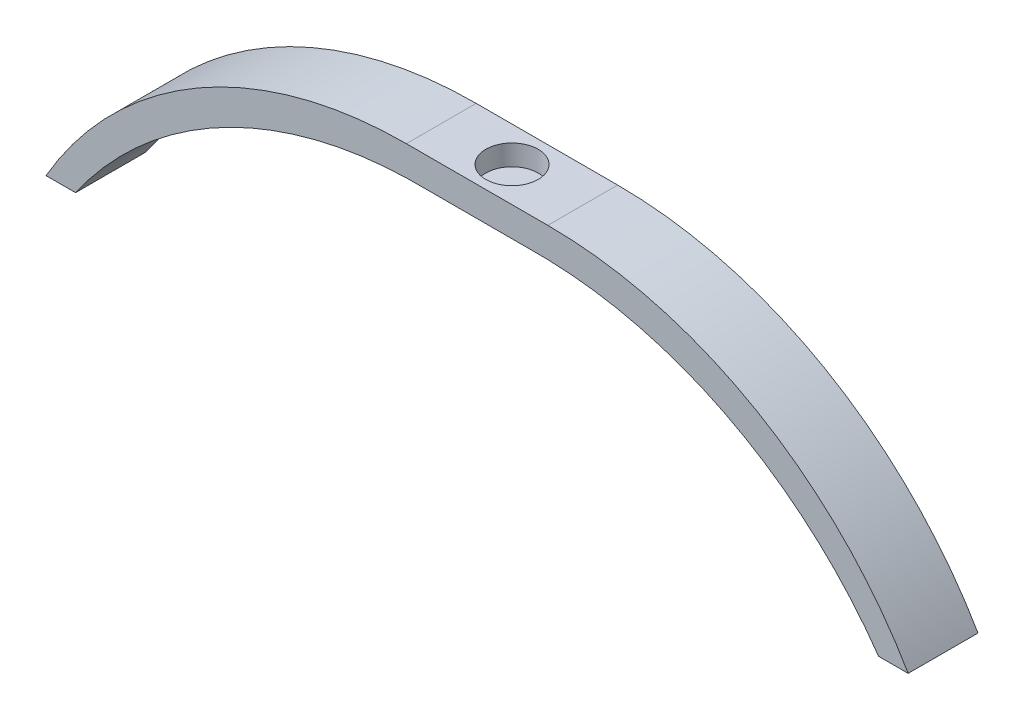
ISO-10303-21;
HEADER;
FILE_DESCRIPTION(('STEP AP214'),'2;1');
FILE_NAME('part.step','',(''),(''),'','','');
FILE_SCHEMA(('AUTOMOTIVE_DESIGN { 1 0 10303 214 1 1 1 1 }'));
ENDSEC;
DATA;
#1=APPLICATION_CONTEXT('core data for automotive mechanical design processes');
#2=APPLICATION_PROTOCOL_DEFINITION('international standard','automotive_design',2000,#1);
#3=PRODUCT_CONTEXT('',#1,'mechanical');
#4=PRODUCT('Part','Part','',(#3));
#5=PRODUCT_RELATED_PRODUCT_CATEGORY('part','',(#4));
#6=PRODUCT_DEFINITION_FORMATION('','',#4);
#7=PRODUCT_DEFINITION_CONTEXT('part definition',#1,'design');
#8=PRODUCT_DEFINITION('design','',#6,#7);
#9=PRODUCT_DEFINITION_SHAPE('','',#8);
#10=(LENGTH_UNIT() NAMED_UNIT(*) SI_UNIT(.MILLI.,.METRE.));
#11=(NAMED_UNIT(*) PLANE_ANGLE_UNIT() SI_UNIT($,.RADIAN.));
#12=(NAMED_UNIT(*) SI_UNIT($,.STERADIAN.) SOLID_ANGLE_UNIT());
#13=UNCERTAINTY_MEASURE_WITH_UNIT(LENGTH_MEASURE(1.E-05),#10,'distance_accuracy_value','');
#14=(GEOMETRIC_REPRESENTATION_CONTEXT(3) GLOBAL_UNCERTAINTY_ASSIGNED_CONTEXT((#13)) GLOBAL_UNIT_ASSIGNED_CONTEXT((#10,
#11,#12)) REPRESENTATION_CONTEXT('',''));
#15=CARTESIAN_POINT('',(0.,0.,0.));
#16=DIRECTION('',(0.,0.,1.));
#17=DIRECTION('',(1.,0.,0.));
#18=AXIS2_PLACEMENT_3D('',#15,#16,#17);
#19=CARTESIAN_POINT('',(-7.62,4.3,-5.08));
#20=DIRECTION('',(0.,0.,1.));
#21=DIRECTION('',(1.,0.,0.));
#22=AXIS2_PLACEMENT_3D('',#19,#20,#21);
#23=PLANE('',#22);
#24=DIRECTION('',(-1.,0.,0.));
#25=VECTOR('',#24,1.);
#26=CARTESIAN_POINT('',(-7.62,0.,-5.08));
#27=LINE('',#26,#25);
#28=CARTESIAN_POINT('',(7.62,0.,-5.08));
#29=VERTEX_POINT('',#28);
#30=CARTESIAN_POINT('',(-7.62,0.,-5.08));
#31=VERTEX_POINT('',#30);
#32=EDGE_CURVE('E59',#29,#31,#27,.T.);
#33=ORIENTED_EDGE('',*,*,#32,.T.);
#34=DIRECTION('',(0.99997133683787,0.00757136068906019,0.));
#35=VECTOR('',#34,1.);
#36=CARTESIAN_POINT('',(-0.000436820330450907,0.0576921147647997,-5.08));
#37=LINE('',#36,#35);
#38=CARTESIAN_POINT('',(-10.29,-0.0202161124975009,-5.08));
#39=VERTEX_POINT('',#38);
#40=EDGE_CURVE('E151',#39,#31,#37,.T.);
#41=ORIENTED_EDGE('',*,*,#40,.F.);
#42=CARTESIAN_POINT('',(-8.72520890316216,-60.57,-5.08));
#43=DIRECTION('',(0.,0.,1.));
#44=DIRECTION('',(1.,0.,0.));
#45=AXIS2_PLACEMENT_3D('',#42,#43,#44);
#46=CIRCLE('',#45,60.57);
#47=CARTESIAN_POINT('',(-58.4191521960827,-25.94,-5.08));
#48=VERTEX_POINT('',#47);
#49=EDGE_CURVE('E122',#48,#39,#46,.F.);
#50=ORIENTED_EDGE('',*,*,#49,.F.);
#51=DIRECTION('',(-1.,0.,0.));
#52=VECTOR('',#51,1.);
#53=CARTESIAN_POINT('',(0.,-25.94,-5.08));
#54=LINE('',#53,#52);
#55=CARTESIAN_POINT('',(-62.7191521960827,-25.94,-5.08));
#56=VERTEX_POINT('',#55);
#57=EDGE_CURVE('E220',#48,#56,#54,.T.);
#58=ORIENTED_EDGE('',*,*,#57,.T.);
#59=CARTESIAN_POINT('',(-10.29,-56.27,-5.08));
#60=DIRECTION('',(0.,0.,1.));
#61=DIRECTION('',(1.,0.,0.));
#62=AXIS2_PLACEMENT_3D('',#59,#60,#61);
#63=CIRCLE('',#62,60.57);
#64=CARTESIAN_POINT('',(-10.29,4.3,-5.08));
#65=VERTEX_POINT('',#64);
#66=EDGE_CURVE('E157',#65,#56,#63,.T.);
#67=ORIENTED_EDGE('',*,*,#66,.F.);
#68=DIRECTION('',(-1.,0.,0.));
#69=VECTOR('',#68,1.);
#70=CARTESIAN_POINT('',(-7.62,4.3,-5.08));
#71=LINE('',#70,#69);
#72=CARTESIAN_POINT('',(10.29,4.3,-5.08));
#73=VERTEX_POINT('',#72);
#74=EDGE_CURVE('E47',#73,#65,#71,.T.);
#75=ORIENTED_EDGE('',*,*,#74,.F.);
#76=CARTESIAN_POINT('',(10.29,-56.27,-5.08));
#77=DIRECTION('',(0.,0.,1.));
#78=DIRECTION('',(1.,0.,0.));
#79=AXIS2_PLACEMENT_3D('',#76,#77,#78);
#80=CIRCLE('',#79,60.57);
#81=CARTESIAN_POINT('',(62.7191521960827,-25.94,-5.08));
#82=VERTEX_POINT('',#81);
#83=EDGE_CURVE('E166',#73,#82,#80,.F.);
#84=ORIENTED_EDGE('',*,*,#83,.T.);
#85=DIRECTION('',(1.,0.,0.));
#86=VECTOR('',#85,1.);
#87=CARTESIAN_POINT('',(0.,-25.94,-5.08));
#88=LINE('',#87,#86);
#89=CARTESIAN_POINT('',(58.4191521960827,-25.94,-5.08));
#90=VERTEX_POINT('',#89);
#91=EDGE_CURVE('E163',#90,#82,#88,.T.);
#92=ORIENTED_EDGE('',*,*,#91,.F.);
#93=CARTESIAN_POINT('',(8.72520890316216,-60.57,-5.08));
#94=DIRECTION('',(0.,0.,1.));
#95=DIRECTION('',(1.,0.,0.));
#96=AXIS2_PLACEMENT_3D('',#93,#94,#95);
#97=CIRCLE('',#96,60.57);
#98=CARTESIAN_POINT('',(10.29,-0.0202161124975009,-5.08));
#99=VERTEX_POINT('',#98);
#100=EDGE_CURVE('E160',#90,#99,#97,.T.);
#101=ORIENTED_EDGE('',*,*,#100,.T.);
#102=DIRECTION('',(-0.99997133683787,0.00757136068906019,0.));
#103=VECTOR('',#102,1.);
#104=CARTESIAN_POINT('',(0.000436820330450907,0.0576921147647997,-5.08));
#105=LINE('',#104,#103);
#106=EDGE_CURVE('E158',#99,#29,#105,.T.);
#107=ORIENTED_EDGE('',*,*,#106,.T.);
#108=EDGE_LOOP('',(#33,#41,#50,#58,#67,#75,#84,#92,#101,#107));
#109=FACE_BOUND('',#108,.T.);
#110=ADVANCED_FACE('F39',(#109),#23,.F.);
#111=CARTESIAN_POINT('',(-7.62,4.3,5.08));
#112=DIRECTION('',(0.,0.,-1.));
#113=DIRECTION('',(-1.,0.,0.));
#114=AXIS2_PLACEMENT_3D('',#111,#112,#113);
#115=PLANE('',#114);
#116=DIRECTION('',(1.,0.,0.));
#117=VECTOR('',#116,1.);
#118=CARTESIAN_POINT('',(-7.62,0.,5.08));
#119=LINE('',#118,#117);
#120=CARTESIAN_POINT('',(-7.62,0.,5.08));
#121=VERTEX_POINT('',#120);
#122=CARTESIAN_POINT('',(7.62,0.,5.08));
#123=VERTEX_POINT('',#122);
#124=EDGE_CURVE('E42',#121,#123,#119,.T.);
#125=ORIENTED_EDGE('',*,*,#124,.T.);
#126=DIRECTION('',(0.99997133683787,-0.00757136068906019,0.));
#127=VECTOR('',#126,1.);
#128=CARTESIAN_POINT('',(0.000436820330450907,0.0576921147647997,5.08));
#129=LINE('',#128,#127);
#130=CARTESIAN_POINT('',(10.29,-0.0202161124975009,5.08));
#131=VERTEX_POINT('',#130);
#132=EDGE_CURVE('E173',#123,#131,#129,.T.);
#133=ORIENTED_EDGE('',*,*,#132,.T.);
#134=CARTESIAN_POINT('',(8.72520890316216,-60.57,5.08));
#135=DIRECTION('',(0.,0.,1.));
#136=DIRECTION('',(1.,0.,0.));
#137=AXIS2_PLACEMENT_3D('',#134,#135,#136);
#138=CIRCLE('',#137,60.57);
#139=CARTESIAN_POINT('',(58.4191521960827,-25.94,5.08));
#140=VERTEX_POINT('',#139);
#141=EDGE_CURVE('E176',#131,#140,#138,.F.);
#142=ORIENTED_EDGE('',*,*,#141,.T.);
#143=DIRECTION('',(-1.,0.,0.));
#144=VECTOR('',#143,1.);
#145=CARTESIAN_POINT('',(0.,-25.94,5.08));
#146=LINE('',#145,#144);
#147=CARTESIAN_POINT('',(62.7191521960827,-25.94,5.08));
#148=VERTEX_POINT('',#147);
#149=EDGE_CURVE('E167',#148,#140,#146,.T.);
#150=ORIENTED_EDGE('',*,*,#149,.F.);
#151=CARTESIAN_POINT('',(10.29,-56.27,5.08));
#152=DIRECTION('',(0.,0.,1.));
#153=DIRECTION('',(1.,0.,0.));
#154=AXIS2_PLACEMENT_3D('',#151,#152,#153);
#155=CIRCLE('',#154,60.57);
#156=CARTESIAN_POINT('',(10.29,4.3,5.08));
#157=VERTEX_POINT('',#156);
#158=EDGE_CURVE('E170',#148,#157,#155,.T.);
#159=ORIENTED_EDGE('',*,*,#158,.T.);
#160=DIRECTION('',(1.,0.,0.));
#161=VECTOR('',#160,1.);
#162=CARTESIAN_POINT('',(-7.62,4.3,5.08));
#163=LINE('',#162,#161);
#164=CARTESIAN_POINT('',(-10.29,4.3,5.08));
#165=VERTEX_POINT('',#164);
#166=EDGE_CURVE('E11',#165,#157,#163,.T.);
#167=ORIENTED_EDGE('',*,*,#166,.F.);
#168=CARTESIAN_POINT('',(-10.29,-56.27,5.08));
#169=DIRECTION('',(0.,0.,1.));
#170=DIRECTION('',(1.,0.,0.));
#171=AXIS2_PLACEMENT_3D('',#168,#169,#170);
#172=CIRCLE('',#171,60.57);
#173=CARTESIAN_POINT('',(-62.7191521960827,-25.94,5.08));
#174=VERTEX_POINT('',#173);
#175=EDGE_CURVE('E133',#174,#165,#172,.F.);
#176=ORIENTED_EDGE('',*,*,#175,.F.);
#177=DIRECTION('',(1.,0.,0.));
#178=VECTOR('',#177,1.);
#179=CARTESIAN_POINT('',(0.,-25.94,5.08));
#180=LINE('',#179,#178);
#181=CARTESIAN_POINT('',(-58.4191521960827,-25.94,5.08));
#182=VERTEX_POINT('',#181);
#183=EDGE_CURVE('E126',#174,#182,#180,.T.);
#184=ORIENTED_EDGE('',*,*,#183,.T.);
#185=CARTESIAN_POINT('',(-8.72520890316216,-60.57,5.08));
#186=DIRECTION('',(0.,0.,1.));
#187=DIRECTION('',(1.,0.,0.));
#188=AXIS2_PLACEMENT_3D('',#185,#186,#187);
#189=CIRCLE('',#188,60.57);
#190=CARTESIAN_POINT('',(-10.29,-0.0202161124975009,5.08));
#191=VERTEX_POINT('',#190);
#192=EDGE_CURVE('E120',#191,#182,#189,.T.);
#193=ORIENTED_EDGE('',*,*,#192,.F.);
#194=DIRECTION('',(-0.99997133683787,-0.00757136068906019,0.));
#195=VECTOR('',#194,1.);
#196=CARTESIAN_POINT('',(-0.000436820330450907,0.0576921147647997,5.08));
#197=LINE('',#196,#195);
#198=EDGE_CURVE('E129',#121,#191,#197,.T.);
#199=ORIENTED_EDGE('',*,*,#198,.F.);
#200=EDGE_LOOP('',(#125,#133,#142,#150,#159,#167,#176,#184,#193,#199));
#201=FACE_BOUND('',#200,.T.);
#202=ADVANCED_FACE('F135',(#201),#115,.F.);
#203=CARTESIAN_POINT('',(0.,4.3,0.));
#204=DIRECTION('',(0.,1.,0.));
#205=DIRECTION('',(0.,0.,1.));
#206=AXIS2_PLACEMENT_3D('',#203,#204,#205);
#207=PLANE('',#206);
#208=CARTESIAN_POINT('',(0.,4.3,0.));
#209=DIRECTION('',(0.,1.,0.));
#210=DIRECTION('',(0.,0.,1.));
#211=AXIS2_PLACEMENT_3D('',#208,#209,#210);
#212=CIRCLE('',#211,3.81);
#213=CARTESIAN_POINT('',(0.,4.3,3.81));
#214=VERTEX_POINT('',#213);
#215=EDGE_CURVE('E141',#214,#214,#212,.T.);
#216=ORIENTED_EDGE('',*,*,#215,.F.);
#217=EDGE_LOOP('',(#216));
#218=FACE_BOUND('',#217,.T.);
#219=ORIENTED_EDGE('',*,*,#166,.T.);
#220=DIRECTION('',(0.,0.,1.));
#221=VECTOR('',#220,1.);
#222=CARTESIAN_POINT('',(10.29,4.3,-67.9320021377766));
#223=LINE('',#222,#221);
#224=EDGE_CURVE('E183',#73,#157,#223,.T.);
#225=ORIENTED_EDGE('',*,*,#224,.F.);
#226=ORIENTED_EDGE('',*,*,#74,.T.);
#227=DIRECTION('',(0.,0.,1.));
#228=VECTOR('',#227,1.);
#229=CARTESIAN_POINT('',(-10.29,4.3,-67.9320021377766));
#230=LINE('',#229,#228);
#231=EDGE_CURVE('E125',#65,#165,#230,.T.);
#232=ORIENTED_EDGE('',*,*,#231,.T.);
#233=EDGE_LOOP('',(#219,#225,#226,#232));
#234=FACE_BOUND('',#233,.T.);
#235=ADVANCED_FACE('F211',(#218,#234),#207,.T.);
#236=CARTESIAN_POINT('',(0.,0.,0.));
#237=DIRECTION('',(0.,1.,0.));
#238=DIRECTION('',(0.,0.,1.));
#239=AXIS2_PLACEMENT_3D('',#236,#237,#238);
#240=PLANE('',#239);
#241=DIRECTION('',(0.,0.,-1.));
#242=VECTOR('',#241,1.);
#243=CARTESIAN_POINT('',(7.62,0.,-5.08));
#244=LINE('',#243,#242);
#245=EDGE_CURVE('E188',#123,#29,#244,.T.);
#246=ORIENTED_EDGE('',*,*,#245,.F.);
#247=ORIENTED_EDGE('',*,*,#124,.F.);
#248=DIRECTION('',(0.,0.,1.));
#249=VECTOR('',#248,1.);
#250=CARTESIAN_POINT('',(-7.62,0.,-5.08));
#251=LINE('',#250,#249);
#252=EDGE_CURVE('E131',#31,#121,#251,.T.);
#253=ORIENTED_EDGE('',*,*,#252,.F.);
#254=ORIENTED_EDGE('',*,*,#32,.F.);
#255=EDGE_LOOP('',(#246,#247,#253,#254));
#256=FACE_BOUND('',#255,.T.);
#257=ADVANCED_FACE('F230',(#256),#240,.F.);
#258=CARTESIAN_POINT('',(0.,-25.94,-67.9320021377766));
#259=DIRECTION('',(0.,1.,0.));
#260=DIRECTION('',(0.,0.,1.));
#261=AXIS2_PLACEMENT_3D('',#258,#259,#260);
#262=PLANE('',#261);
#263=DIRECTION('',(0.,0.,1.));
#264=VECTOR('',#263,1.);
#265=CARTESIAN_POINT('',(58.4191521960827,-25.94,-67.9320021377766));
#266=LINE('',#265,#264);
#267=EDGE_CURVE('E161',#90,#140,#266,.T.);
#268=ORIENTED_EDGE('',*,*,#267,.F.);
#269=ORIENTED_EDGE('',*,*,#91,.T.);
#270=DIRECTION('',(0.,0.,1.));
#271=VECTOR('',#270,1.);
#272=CARTESIAN_POINT('',(62.7191521960827,-25.94,-67.9320021377766));
#273=LINE('',#272,#271);
#274=EDGE_CURVE('E179',#82,#148,#273,.T.);
#275=ORIENTED_EDGE('',*,*,#274,.T.);
#276=ORIENTED_EDGE('',*,*,#149,.T.);
#277=EDGE_LOOP('',(#268,#269,#275,#276));
#278=FACE_BOUND('',#277,.T.);
#279=ADVANCED_FACE('F236',(#278),#262,.F.);
#280=CARTESIAN_POINT('',(8.72520890316216,-60.57,-67.9320021377766));
#281=DIRECTION('',(0.,0.,1.));
#282=DIRECTION('',(1.,0.,0.));
#283=AXIS2_PLACEMENT_3D('',#280,#281,#282);
#284=CYLINDRICAL_SURFACE('',#283,60.57);
#285=ORIENTED_EDGE('',*,*,#100,.F.);
#286=ORIENTED_EDGE('',*,*,#267,.T.);
#287=ORIENTED_EDGE('',*,*,#141,.F.);
#288=DIRECTION('',(0.,0.,1.));
#289=VECTOR('',#288,1.);
#290=CARTESIAN_POINT('',(10.29,-0.0202161124975009,-67.9320021377766));
#291=LINE('',#290,#289);
#292=EDGE_CURVE('E181',#99,#131,#291,.T.);
#293=ORIENTED_EDGE('',*,*,#292,.F.);
#294=EDGE_LOOP('',(#285,#286,#287,#293));
#295=FACE_BOUND('',#294,.T.);
#296=ADVANCED_FACE('F200',(#295),#284,.F.);
#297=CARTESIAN_POINT('',(0.000436820330450907,0.0576921147647997,-67.9320021377766));
#298=DIRECTION('',(-0.00757136068906019,-0.99997133683787,0.));
#299=DIRECTION('',(0.99997133683787,-0.00757136068906019,0.));
#300=AXIS2_PLACEMENT_3D('',#297,#298,#299);
#301=PLANE('',#300);
#302=ORIENTED_EDGE('',*,*,#106,.F.);
#303=ORIENTED_EDGE('',*,*,#292,.T.);
#304=ORIENTED_EDGE('',*,*,#132,.F.);
#305=ORIENTED_EDGE('',*,*,#245,.T.);
#306=EDGE_LOOP('',(#302,#303,#304,#305));
#307=FACE_BOUND('',#306,.T.);
#308=ADVANCED_FACE('F196',(#307),#301,.T.);
#309=CARTESIAN_POINT('',(10.29,-56.27,-67.9320021377766));
#310=DIRECTION('',(0.,0.,1.));
#311=DIRECTION('',(1.,0.,0.));
#312=AXIS2_PLACEMENT_3D('',#309,#310,#311);
#313=CYLINDRICAL_SURFACE('',#312,60.57);
#314=ORIENTED_EDGE('',*,*,#83,.F.);
#315=ORIENTED_EDGE('',*,*,#224,.T.);
#316=ORIENTED_EDGE('',*,*,#158,.F.);
#317=ORIENTED_EDGE('',*,*,#274,.F.);
#318=EDGE_LOOP('',(#314,#315,#316,#317));
#319=FACE_BOUND('',#318,.T.);
#320=ADVANCED_FACE('F208',(#319),#313,.T.);
#321=CARTESIAN_POINT('',(-0.000436820330450907,0.0576921147647997,-67.9320021377766));
#322=DIRECTION('',(-0.00757136068906019,0.99997133683787,0.));
#323=DIRECTION('',(-0.99997133683787,-0.00757136068906019,0.));
#324=AXIS2_PLACEMENT_3D('',#321,#322,#323);
#325=PLANE('',#324);
#326=DIRECTION('',(0.,0.,1.));
#327=VECTOR('',#326,1.);
#328=CARTESIAN_POINT('',(-10.29,-0.0202161124975009,-67.9320021377766));
#329=LINE('',#328,#327);
#330=EDGE_CURVE('E115',#39,#191,#329,.T.);
#331=ORIENTED_EDGE('',*,*,#330,.F.);
#332=ORIENTED_EDGE('',*,*,#40,.T.);
#333=ORIENTED_EDGE('',*,*,#252,.T.);
#334=ORIENTED_EDGE('',*,*,#198,.T.);
#335=EDGE_LOOP('',(#331,#332,#333,#334));
#336=FACE_BOUND('',#335,.T.);
#337=ADVANCED_FACE('F130',(#336),#325,.F.);
#338=CARTESIAN_POINT('',(-10.29,-56.27,-67.9320021377766));
#339=DIRECTION('',(0.,0.,1.));
#340=DIRECTION('',(1.,0.,0.));
#341=AXIS2_PLACEMENT_3D('',#338,#339,#340);
#342=CYLINDRICAL_SURFACE('',#341,60.57);
#343=ORIENTED_EDGE('',*,*,#231,.F.);
#344=ORIENTED_EDGE('',*,*,#66,.T.);
#345=DIRECTION('',(0.,0.,1.));
#346=VECTOR('',#345,1.);
#347=CARTESIAN_POINT('',(-62.7191521960827,-25.94,-67.9320021377766));
#348=LINE('',#347,#346);
#349=EDGE_CURVE('E152',#56,#174,#348,.T.);
#350=ORIENTED_EDGE('',*,*,#349,.T.);
#351=ORIENTED_EDGE('',*,*,#175,.T.);
#352=EDGE_LOOP('',(#343,#344,#350,#351));
#353=FACE_BOUND('',#352,.T.);
#354=ADVANCED_FACE('F256',(#353),#342,.T.);
#355=CARTESIAN_POINT('',(0.,-25.94,-67.9320021377766));
#356=DIRECTION('',(0.,-1.,0.));
#357=DIRECTION('',(0.,0.,-1.));
#358=AXIS2_PLACEMENT_3D('',#355,#356,#357);
#359=PLANE('',#358);
#360=ORIENTED_EDGE('',*,*,#57,.F.);
#361=DIRECTION('',(0.,0.,1.));
#362=VECTOR('',#361,1.);
#363=CARTESIAN_POINT('',(-58.4191521960827,-25.94,-67.9320021377766));
#364=LINE('',#363,#362);
#365=EDGE_CURVE('E149',#48,#182,#364,.T.);
#366=ORIENTED_EDGE('',*,*,#365,.T.);
#367=ORIENTED_EDGE('',*,*,#183,.F.);
#368=ORIENTED_EDGE('',*,*,#349,.F.);
#369=EDGE_LOOP('',(#360,#366,#367,#368));
#370=FACE_BOUND('',#369,.T.);
#371=ADVANCED_FACE('F218',(#370),#359,.T.);
#372=CARTESIAN_POINT('',(-8.72520890316216,-60.57,-67.9320021377766));
#373=DIRECTION('',(0.,0.,1.));
#374=DIRECTION('',(1.,0.,0.));
#375=AXIS2_PLACEMENT_3D('',#372,#373,#374);
#376=CYLINDRICAL_SURFACE('',#375,60.57);
#377=ORIENTED_EDGE('',*,*,#365,.F.);
#378=ORIENTED_EDGE('',*,*,#49,.T.);
#379=ORIENTED_EDGE('',*,*,#330,.T.);
#380=ORIENTED_EDGE('',*,*,#192,.T.);
#381=EDGE_LOOP('',(#377,#378,#379,#380));
#382=FACE_BOUND('',#381,.T.);
#383=ADVANCED_FACE('F118',(#382),#376,.F.);
#384=CARTESIAN_POINT('',(0.,1.3,0.));
#385=DIRECTION('',(0.,1.,0.));
#386=DIRECTION('',(0.,0.,1.));
#387=AXIS2_PLACEMENT_3D('',#384,#385,#386);
#388=CYLINDRICAL_SURFACE('',#387,3.81);
#389=CARTESIAN_POINT('',(0.,1.3,0.));
#390=DIRECTION('',(0.,1.,0.));
#391=DIRECTION('',(0.,0.,1.));
#392=AXIS2_PLACEMENT_3D('',#389,#390,#391);
#393=CIRCLE('',#392,3.81);
#394=CARTESIAN_POINT('',(0.,1.3,3.81));
#395=VERTEX_POINT('',#394);
#396=EDGE_CURVE('E138',#395,#395,#393,.T.);
#397=ORIENTED_EDGE('',*,*,#396,.F.);
#398=EDGE_LOOP('',(#397));
#399=FACE_BOUND('',#398,.T.);
#400=ORIENTED_EDGE('',*,*,#215,.T.);
#401=EDGE_LOOP('',(#400));
#402=FACE_BOUND('',#401,.T.);
#403=ADVANCED_FACE('F227',(#399,#402),#388,.F.);
#404=CARTESIAN_POINT('',(0.,1.3,0.));
#405=DIRECTION('',(0.,1.,0.));
#406=DIRECTION('',(0.,0.,1.));
#407=AXIS2_PLACEMENT_3D('',#404,#405,#406);
#408=PLANE('',#407);
#409=ORIENTED_EDGE('',*,*,#396,.T.);
#410=EDGE_LOOP('',(#409));
#411=FACE_BOUND('',#410,.T.);
#412=ADVANCED_FACE('F263',(#411),#408,.T.);
#413=CLOSED_SHELL('',(#110,#202,#235,#257,#279,#296,#308,#320,#337,#354,#371,#383,#403,#412));
#414=MANIFOLD_SOLID_BREP('B2',#413);
#415=ADVANCED_BREP_SHAPE_REPRESENTATION('',(#18,#414),#14);
#416=SHAPE_DEFINITION_REPRESENTATION(#9,#415);
ENDSEC;
END-ISO-10303-21;
